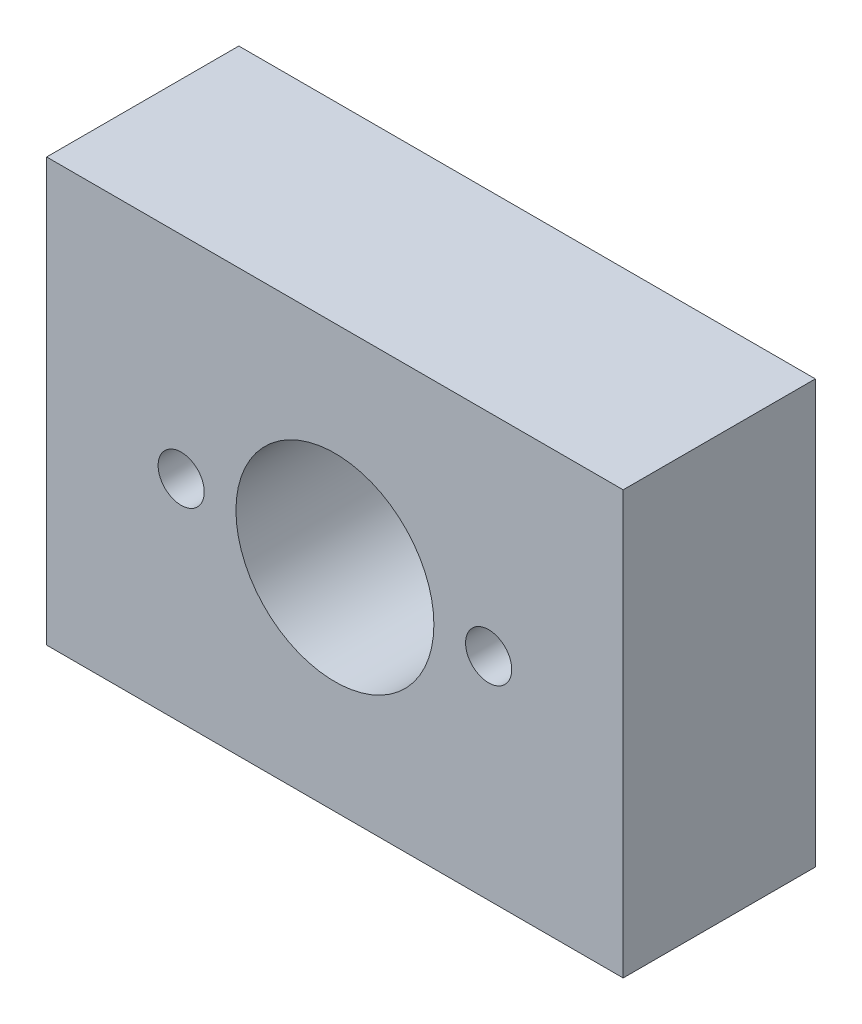
ISO-10303-21;
HEADER;
FILE_DESCRIPTION(('STEP AP214'),'2;1');
FILE_NAME('part.step','',(''),(''),'','','');
FILE_SCHEMA(('AUTOMOTIVE_DESIGN { 1 0 10303 214 1 1 1 1 }'));
ENDSEC;
DATA;
#1=APPLICATION_CONTEXT('core data for automotive mechanical design processes');
#2=APPLICATION_PROTOCOL_DEFINITION('international standard','automotive_design',2000,#1);
#3=PRODUCT_CONTEXT('',#1,'mechanical');
#4=PRODUCT('Part','Part','',(#3));
#5=PRODUCT_RELATED_PRODUCT_CATEGORY('part','',(#4));
#6=PRODUCT_DEFINITION_FORMATION('','',#4);
#7=PRODUCT_DEFINITION_CONTEXT('part definition',#1,'design');
#8=PRODUCT_DEFINITION('design','',#6,#7);
#9=PRODUCT_DEFINITION_SHAPE('','',#8);
#10=(LENGTH_UNIT() NAMED_UNIT(*) SI_UNIT(.MILLI.,.METRE.));
#11=(NAMED_UNIT(*) PLANE_ANGLE_UNIT() SI_UNIT($,.RADIAN.));
#12=(NAMED_UNIT(*) SI_UNIT($,.STERADIAN.) SOLID_ANGLE_UNIT());
#13=UNCERTAINTY_MEASURE_WITH_UNIT(LENGTH_MEASURE(1.E-05),#10,'distance_accuracy_value','');
#14=(GEOMETRIC_REPRESENTATION_CONTEXT(3) GLOBAL_UNCERTAINTY_ASSIGNED_CONTEXT((#13)) GLOBAL_UNIT_ASSIGNED_CONTEXT((#10,
#11,#12)) REPRESENTATION_CONTEXT('',''));
#15=CARTESIAN_POINT('',(0.,0.,0.));
#16=DIRECTION('',(0.,0.,1.));
#17=DIRECTION('',(1.,0.,0.));
#18=AXIS2_PLACEMENT_3D('',#15,#16,#17);
#19=CARTESIAN_POINT('',(0.,0.,10.));
#20=DIRECTION('',(0.,0.,1.));
#21=DIRECTION('',(1.,0.,0.));
#22=AXIS2_PLACEMENT_3D('',#19,#20,#21);
#23=PLANE('',#22);
#24=CARTESIAN_POINT('',(-8.,0.,10.));
#25=DIRECTION('',(0.,0.,1.));
#26=DIRECTION('',(1.,0.,0.));
#27=AXIS2_PLACEMENT_3D('',#24,#25,#26);
#28=CIRCLE('',#27,1.2);
#29=CARTESIAN_POINT('',(-6.8,0.,10.));
#30=VERTEX_POINT('',#29);
#31=EDGE_CURVE('E137',#30,#30,#28,.T.);
#32=ORIENTED_EDGE('',*,*,#31,.F.);
#33=EDGE_LOOP('',(#32));
#34=FACE_BOUND('',#33,.T.);
#35=CARTESIAN_POINT('',(8.,0.,10.));
#36=DIRECTION('',(0.,0.,1.));
#37=DIRECTION('',(-1.,0.,0.));
#38=AXIS2_PLACEMENT_3D('',#35,#36,#37);
#39=CIRCLE('',#38,1.2);
#40=CARTESIAN_POINT('',(6.8,0.,10.));
#41=VERTEX_POINT('',#40);
#42=EDGE_CURVE('E131',#41,#41,#39,.T.);
#43=ORIENTED_EDGE('',*,*,#42,.F.);
#44=EDGE_LOOP('',(#43));
#45=FACE_BOUND('',#44,.T.);
#46=DIRECTION('',(0.,-1.,0.));
#47=VECTOR('',#46,1.);
#48=CARTESIAN_POINT('',(-15.,-11.,10.));
#49=LINE('',#48,#47);
#50=CARTESIAN_POINT('',(-15.,11.,10.));
#51=VERTEX_POINT('',#50);
#52=CARTESIAN_POINT('',(-15.,-11.,10.));
#53=VERTEX_POINT('',#52);
#54=EDGE_CURVE('E86',#51,#53,#49,.T.);
#55=ORIENTED_EDGE('',*,*,#54,.T.);
#56=DIRECTION('',(1.,0.,0.));
#57=VECTOR('',#56,1.);
#58=CARTESIAN_POINT('',(15.,-11.,10.));
#59=LINE('',#58,#57);
#60=CARTESIAN_POINT('',(15.,-11.,10.));
#61=VERTEX_POINT('',#60);
#62=EDGE_CURVE('E81',#53,#61,#59,.T.);
#63=ORIENTED_EDGE('',*,*,#62,.T.);
#64=DIRECTION('',(0.,1.,0.));
#65=VECTOR('',#64,1.);
#66=CARTESIAN_POINT('',(15.,-11.,10.));
#67=LINE('',#66,#65);
#68=CARTESIAN_POINT('',(15.,11.,10.));
#69=VERTEX_POINT('',#68);
#70=EDGE_CURVE('E84',#61,#69,#67,.T.);
#71=ORIENTED_EDGE('',*,*,#70,.T.);
#72=DIRECTION('',(-1.,0.,0.));
#73=VECTOR('',#72,1.);
#74=CARTESIAN_POINT('',(15.,11.,10.));
#75=LINE('',#74,#73);
#76=EDGE_CURVE('E51',#69,#51,#75,.T.);
#77=ORIENTED_EDGE('',*,*,#76,.T.);
#78=EDGE_LOOP('',(#55,#63,#71,#77));
#79=FACE_BOUND('',#78,.T.);
#80=CARTESIAN_POINT('',(0.,0.,10.));
#81=DIRECTION('',(0.,0.,1.));
#82=DIRECTION('',(1.,0.,0.));
#83=AXIS2_PLACEMENT_3D('',#80,#81,#82);
#84=CIRCLE('',#83,5.15);
#85=CARTESIAN_POINT('',(5.15,0.,10.));
#86=VERTEX_POINT('',#85);
#87=EDGE_CURVE('E101',#86,#86,#84,.T.);
#88=ORIENTED_EDGE('',*,*,#87,.F.);
#89=EDGE_LOOP('',(#88));
#90=FACE_BOUND('',#89,.T.);
#91=ADVANCED_FACE('F34',(#34,#45,#79,#90),#23,.T.);
#92=CARTESIAN_POINT('',(0.,0.,0.));
#93=DIRECTION('',(0.,0.,1.));
#94=DIRECTION('',(1.,0.,0.));
#95=AXIS2_PLACEMENT_3D('',#92,#93,#94);
#96=PLANE('',#95);
#97=CARTESIAN_POINT('',(-8.,0.,0.));
#98=DIRECTION('',(0.,0.,1.));
#99=DIRECTION('',(1.,0.,0.));
#100=AXIS2_PLACEMENT_3D('',#97,#98,#99);
#101=CIRCLE('',#100,1.2);
#102=CARTESIAN_POINT('',(-6.8,0.,0.));
#103=VERTEX_POINT('',#102);
#104=EDGE_CURVE('E123',#103,#103,#101,.T.);
#105=ORIENTED_EDGE('',*,*,#104,.T.);
#106=EDGE_LOOP('',(#105));
#107=FACE_BOUND('',#106,.T.);
#108=CARTESIAN_POINT('',(8.,0.,0.));
#109=DIRECTION('',(0.,0.,1.));
#110=DIRECTION('',(-1.,0.,0.));
#111=AXIS2_PLACEMENT_3D('',#108,#109,#110);
#112=CIRCLE('',#111,1.2);
#113=CARTESIAN_POINT('',(6.8,0.,0.));
#114=VERTEX_POINT('',#113);
#115=EDGE_CURVE('E134',#114,#114,#112,.T.);
#116=ORIENTED_EDGE('',*,*,#115,.T.);
#117=EDGE_LOOP('',(#116));
#118=FACE_BOUND('',#117,.T.);
#119=DIRECTION('',(0.,-1.,0.));
#120=VECTOR('',#119,1.);
#121=CARTESIAN_POINT('',(-15.,-11.,0.));
#122=LINE('',#121,#120);
#123=CARTESIAN_POINT('',(-15.,11.,0.));
#124=VERTEX_POINT('',#123);
#125=CARTESIAN_POINT('',(-15.,-11.,0.));
#126=VERTEX_POINT('',#125);
#127=EDGE_CURVE('E98',#124,#126,#122,.T.);
#128=ORIENTED_EDGE('',*,*,#127,.F.);
#129=DIRECTION('',(-1.,0.,0.));
#130=VECTOR('',#129,1.);
#131=CARTESIAN_POINT('',(15.,11.,0.));
#132=LINE('',#131,#130);
#133=CARTESIAN_POINT('',(15.,11.,0.));
#134=VERTEX_POINT('',#133);
#135=EDGE_CURVE('E74',#134,#124,#132,.T.);
#136=ORIENTED_EDGE('',*,*,#135,.F.);
#137=DIRECTION('',(0.,1.,0.));
#138=VECTOR('',#137,1.);
#139=CARTESIAN_POINT('',(15.,-11.,0.));
#140=LINE('',#139,#138);
#141=CARTESIAN_POINT('',(15.,-11.,0.));
#142=VERTEX_POINT('',#141);
#143=EDGE_CURVE('E68',#142,#134,#140,.T.);
#144=ORIENTED_EDGE('',*,*,#143,.F.);
#145=DIRECTION('',(1.,0.,0.));
#146=VECTOR('',#145,1.);
#147=CARTESIAN_POINT('',(15.,-11.,0.));
#148=LINE('',#147,#146);
#149=EDGE_CURVE('E90',#126,#142,#148,.T.);
#150=ORIENTED_EDGE('',*,*,#149,.F.);
#151=EDGE_LOOP('',(#128,#136,#144,#150));
#152=FACE_BOUND('',#151,.T.);
#153=CARTESIAN_POINT('',(0.,0.,0.));
#154=DIRECTION('',(0.,0.,1.));
#155=DIRECTION('',(1.,0.,0.));
#156=AXIS2_PLACEMENT_3D('',#153,#154,#155);
#157=CIRCLE('',#156,5.15);
#158=CARTESIAN_POINT('',(5.15,0.,0.));
#159=VERTEX_POINT('',#158);
#160=EDGE_CURVE('E113',#159,#159,#157,.T.);
#161=ORIENTED_EDGE('',*,*,#160,.T.);
#162=EDGE_LOOP('',(#161));
#163=FACE_BOUND('',#162,.T.);
#164=ADVANCED_FACE('F109',(#107,#118,#152,#163),#96,.F.);
#165=CARTESIAN_POINT('',(-15.,-11.,10.));
#166=DIRECTION('',(1.,0.,0.));
#167=DIRECTION('',(0.,0.,-1.));
#168=AXIS2_PLACEMENT_3D('',#165,#166,#167);
#169=PLANE('',#168);
#170=ORIENTED_EDGE('',*,*,#127,.T.);
#171=DIRECTION('',(0.,0.,-1.));
#172=VECTOR('',#171,1.);
#173=CARTESIAN_POINT('',(-15.,-11.,10.));
#174=LINE('',#173,#172);
#175=EDGE_CURVE('E11',#53,#126,#174,.T.);
#176=ORIENTED_EDGE('',*,*,#175,.F.);
#177=ORIENTED_EDGE('',*,*,#54,.F.);
#178=DIRECTION('',(0.,0.,-1.));
#179=VECTOR('',#178,1.);
#180=CARTESIAN_POINT('',(-15.,11.,10.));
#181=LINE('',#180,#179);
#182=EDGE_CURVE('E94',#51,#124,#181,.T.);
#183=ORIENTED_EDGE('',*,*,#182,.T.);
#184=EDGE_LOOP('',(#170,#176,#177,#183));
#185=FACE_BOUND('',#184,.T.);
#186=ADVANCED_FACE('F36',(#185),#169,.F.);
#187=CARTESIAN_POINT('',(15.,-11.,10.));
#188=DIRECTION('',(0.,1.,0.));
#189=DIRECTION('',(0.,0.,1.));
#190=AXIS2_PLACEMENT_3D('',#187,#188,#189);
#191=PLANE('',#190);
#192=CARTESIAN_POINT('',(-11.,-11.,5.));
#193=DIRECTION('',(0.,-1.,0.));
#194=DIRECTION('',(0.,0.,-1.));
#195=AXIS2_PLACEMENT_3D('',#192,#193,#194);
#196=CIRCLE('',#195,2.);
#197=CARTESIAN_POINT('',(-11.,-11.,3.));
#198=VERTEX_POINT('',#197);
#199=EDGE_CURVE('E126',#198,#198,#196,.T.);
#200=ORIENTED_EDGE('',*,*,#199,.F.);
#201=EDGE_LOOP('',(#200));
#202=FACE_BOUND('',#201,.T.);
#203=CARTESIAN_POINT('',(11.,-11.,5.));
#204=DIRECTION('',(0.,-1.,0.));
#205=DIRECTION('',(0.,0.,1.));
#206=AXIS2_PLACEMENT_3D('',#203,#204,#205);
#207=CIRCLE('',#206,2.);
#208=CARTESIAN_POINT('',(11.,-11.,7.));
#209=VERTEX_POINT('',#208);
#210=EDGE_CURVE('E119',#209,#209,#207,.T.);
#211=ORIENTED_EDGE('',*,*,#210,.F.);
#212=EDGE_LOOP('',(#211));
#213=FACE_BOUND('',#212,.T.);
#214=ORIENTED_EDGE('',*,*,#149,.T.);
#215=DIRECTION('',(0.,0.,-1.));
#216=VECTOR('',#215,1.);
#217=CARTESIAN_POINT('',(15.,-11.,10.));
#218=LINE('',#217,#216);
#219=EDGE_CURVE('E43',#61,#142,#218,.T.);
#220=ORIENTED_EDGE('',*,*,#219,.F.);
#221=ORIENTED_EDGE('',*,*,#62,.F.);
#222=ORIENTED_EDGE('',*,*,#175,.T.);
#223=EDGE_LOOP('',(#214,#220,#221,#222));
#224=FACE_BOUND('',#223,.T.);
#225=ADVANCED_FACE('F89',(#202,#213,#224),#191,.F.);
#226=CARTESIAN_POINT('',(15.,-11.,10.));
#227=DIRECTION('',(-1.,0.,0.));
#228=DIRECTION('',(0.,0.,1.));
#229=AXIS2_PLACEMENT_3D('',#226,#227,#228);
#230=PLANE('',#229);
#231=ORIENTED_EDGE('',*,*,#143,.T.);
#232=DIRECTION('',(0.,0.,-1.));
#233=VECTOR('',#232,1.);
#234=CARTESIAN_POINT('',(15.,11.,10.));
#235=LINE('',#234,#233);
#236=EDGE_CURVE('E91',#69,#134,#235,.T.);
#237=ORIENTED_EDGE('',*,*,#236,.F.);
#238=ORIENTED_EDGE('',*,*,#70,.F.);
#239=ORIENTED_EDGE('',*,*,#219,.T.);
#240=EDGE_LOOP('',(#231,#237,#238,#239));
#241=FACE_BOUND('',#240,.T.);
#242=ADVANCED_FACE('F92',(#241),#230,.F.);
#243=CARTESIAN_POINT('',(15.,11.,10.));
#244=DIRECTION('',(0.,-1.,0.));
#245=DIRECTION('',(0.,0.,-1.));
#246=AXIS2_PLACEMENT_3D('',#243,#244,#245);
#247=PLANE('',#246);
#248=ORIENTED_EDGE('',*,*,#135,.T.);
#249=ORIENTED_EDGE('',*,*,#182,.F.);
#250=ORIENTED_EDGE('',*,*,#76,.F.);
#251=ORIENTED_EDGE('',*,*,#236,.T.);
#252=EDGE_LOOP('',(#248,#249,#250,#251));
#253=FACE_BOUND('',#252,.T.);
#254=ADVANCED_FACE('F106',(#253),#247,.F.);
#255=CARTESIAN_POINT('',(0.,0.,10.));
#256=DIRECTION('',(0.,0.,-1.));
#257=DIRECTION('',(-1.,0.,0.));
#258=AXIS2_PLACEMENT_3D('',#255,#256,#257);
#259=CYLINDRICAL_SURFACE('',#258,5.15);
#260=ORIENTED_EDGE('',*,*,#87,.T.);
#261=EDGE_LOOP('',(#260));
#262=FACE_BOUND('',#261,.T.);
#263=ORIENTED_EDGE('',*,*,#160,.F.);
#264=EDGE_LOOP('',(#263));
#265=FACE_BOUND('',#264,.T.);
#266=ADVANCED_FACE('F179',(#262,#265),#259,.F.);
#267=CARTESIAN_POINT('',(11.,-1.,5.));
#268=DIRECTION('',(0.,-1.,0.));
#269=DIRECTION('',(0.,0.,-1.));
#270=AXIS2_PLACEMENT_3D('',#267,#268,#269);
#271=CYLINDRICAL_SURFACE('',#270,2.);
#272=CARTESIAN_POINT('',(11.,-1.,5.));
#273=DIRECTION('',(0.,-1.,0.));
#274=DIRECTION('',(0.,0.,1.));
#275=AXIS2_PLACEMENT_3D('',#272,#273,#274);
#276=CIRCLE('',#275,2.);
#277=CARTESIAN_POINT('',(11.,-1.,7.));
#278=VERTEX_POINT('',#277);
#279=EDGE_CURVE('E122',#278,#278,#276,.T.);
#280=ORIENTED_EDGE('',*,*,#279,.F.);
#281=EDGE_LOOP('',(#280));
#282=FACE_BOUND('',#281,.T.);
#283=ORIENTED_EDGE('',*,*,#210,.T.);
#284=EDGE_LOOP('',(#283));
#285=FACE_BOUND('',#284,.T.);
#286=ADVANCED_FACE('F175',(#282,#285),#271,.F.);
#287=CARTESIAN_POINT('',(11.,-1.,5.));
#288=DIRECTION('',(0.,1.,0.));
#289=DIRECTION('',(0.,0.,1.));
#290=AXIS2_PLACEMENT_3D('',#287,#288,#289);
#291=PLANE('',#290);
#292=ORIENTED_EDGE('',*,*,#279,.T.);
#293=EDGE_LOOP('',(#292));
#294=FACE_BOUND('',#293,.T.);
#295=ADVANCED_FACE('F171',(#294),#291,.F.);
#296=CARTESIAN_POINT('',(-11.,-1.,5.));
#297=DIRECTION('',(0.,-1.,0.));
#298=DIRECTION('',(0.,0.,-1.));
#299=AXIS2_PLACEMENT_3D('',#296,#297,#298);
#300=CYLINDRICAL_SURFACE('',#299,2.);
#301=CARTESIAN_POINT('',(-11.,-1.,5.));
#302=DIRECTION('',(0.,-1.,0.));
#303=DIRECTION('',(0.,0.,-1.));
#304=AXIS2_PLACEMENT_3D('',#301,#302,#303);
#305=CIRCLE('',#304,2.);
#306=CARTESIAN_POINT('',(-11.,-1.,3.));
#307=VERTEX_POINT('',#306);
#308=EDGE_CURVE('E116',#307,#307,#305,.T.);
#309=ORIENTED_EDGE('',*,*,#308,.F.);
#310=EDGE_LOOP('',(#309));
#311=FACE_BOUND('',#310,.T.);
#312=ORIENTED_EDGE('',*,*,#199,.T.);
#313=EDGE_LOOP('',(#312));
#314=FACE_BOUND('',#313,.T.);
#315=ADVANCED_FACE('F164',(#311,#314),#300,.F.);
#316=CARTESIAN_POINT('',(-11.,-1.,5.));
#317=DIRECTION('',(0.,-1.,0.));
#318=DIRECTION('',(0.,0.,-1.));
#319=AXIS2_PLACEMENT_3D('',#316,#317,#318);
#320=PLANE('',#319);
#321=ORIENTED_EDGE('',*,*,#308,.T.);
#322=EDGE_LOOP('',(#321));
#323=FACE_BOUND('',#322,.T.);
#324=ADVANCED_FACE('F158',(#323),#320,.T.);
#325=CARTESIAN_POINT('',(8.,0.,0.));
#326=DIRECTION('',(0.,0.,1.));
#327=DIRECTION('',(1.,0.,0.));
#328=AXIS2_PLACEMENT_3D('',#325,#326,#327);
#329=CYLINDRICAL_SURFACE('',#328,1.2);
#330=ORIENTED_EDGE('',*,*,#115,.F.);
#331=EDGE_LOOP('',(#330));
#332=FACE_BOUND('',#331,.T.);
#333=ORIENTED_EDGE('',*,*,#42,.T.);
#334=EDGE_LOOP('',(#333));
#335=FACE_BOUND('',#334,.T.);
#336=ADVANCED_FACE('F148',(#332,#335),#329,.F.);
#337=CARTESIAN_POINT('',(-8.,0.,0.));
#338=DIRECTION('',(0.,0.,1.));
#339=DIRECTION('',(1.,0.,0.));
#340=AXIS2_PLACEMENT_3D('',#337,#338,#339);
#341=CYLINDRICAL_SURFACE('',#340,1.2);
#342=ORIENTED_EDGE('',*,*,#104,.F.);
#343=EDGE_LOOP('',(#342));
#344=FACE_BOUND('',#343,.T.);
#345=ORIENTED_EDGE('',*,*,#31,.T.);
#346=EDGE_LOOP('',(#345));
#347=FACE_BOUND('',#346,.T.);
#348=ADVANCED_FACE('F145',(#344,#347),#341,.F.);
#349=CLOSED_SHELL('',(#91,#164,#186,#225,#242,#254,#266,#286,#295,#315,#324,#336,#348));
#350=MANIFOLD_SOLID_BREP('B2',#349);
#351=ADVANCED_BREP_SHAPE_REPRESENTATION('',(#18,#350),#14);
#352=SHAPE_DEFINITION_REPRESENTATION(#9,#351);
ENDSEC;
END-ISO-10303-21;
